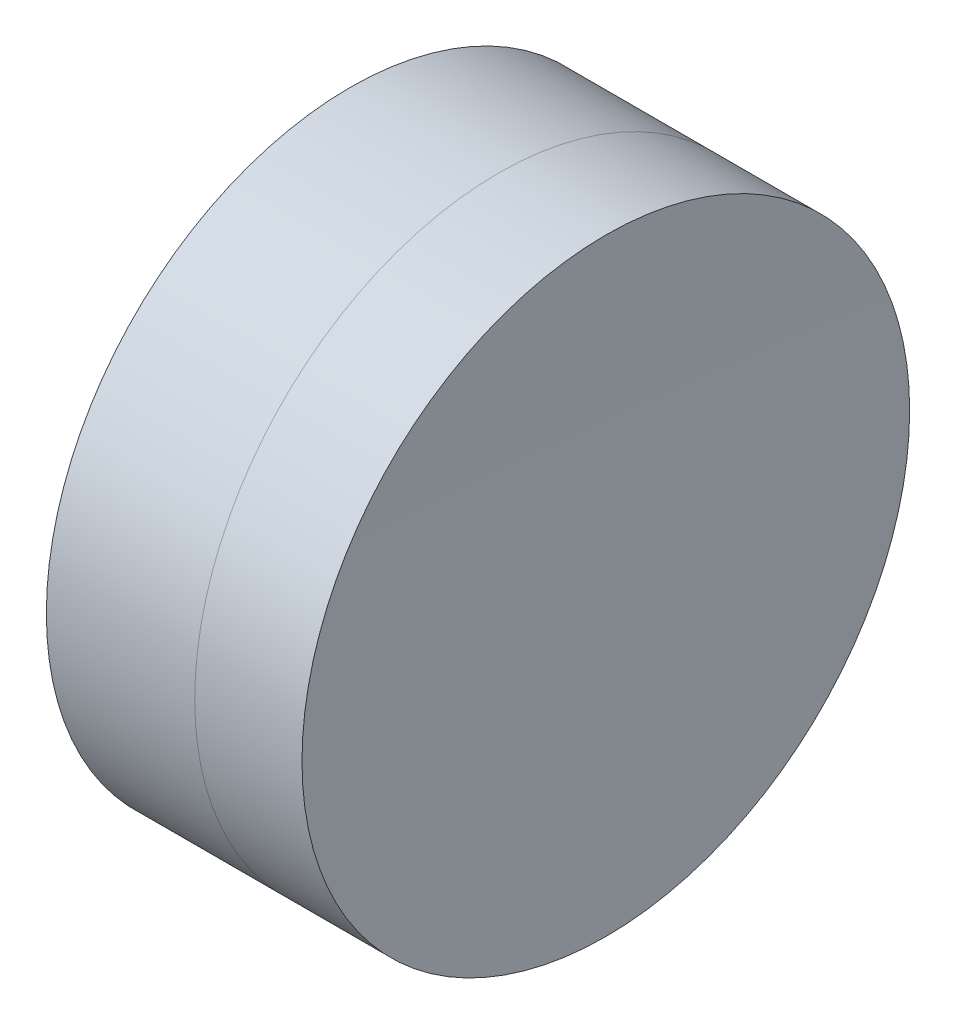
ISO-10303-21;
HEADER;
FILE_DESCRIPTION(('STEP AP214'),'2;1');
FILE_NAME('part.step','',(''),(''),'','','');
FILE_SCHEMA(('AUTOMOTIVE_DESIGN { 1 0 10303 214 1 1 1 1 }'));
ENDSEC;
DATA;
#1=APPLICATION_CONTEXT('core data for automotive mechanical design processes');
#2=APPLICATION_PROTOCOL_DEFINITION('international standard','automotive_design',2000,#1);
#3=PRODUCT_CONTEXT('',#1,'mechanical');
#4=PRODUCT('Part','Part','',(#3));
#5=PRODUCT_RELATED_PRODUCT_CATEGORY('part','',(#4));
#6=PRODUCT_DEFINITION_FORMATION('','',#4);
#7=PRODUCT_DEFINITION_CONTEXT('part definition',#1,'design');
#8=PRODUCT_DEFINITION('design','',#6,#7);
#9=PRODUCT_DEFINITION_SHAPE('','',#8);
#10=(LENGTH_UNIT() NAMED_UNIT(*) SI_UNIT(.MILLI.,.METRE.));
#11=(NAMED_UNIT(*) PLANE_ANGLE_UNIT() SI_UNIT($,.RADIAN.));
#12=(NAMED_UNIT(*) SI_UNIT($,.STERADIAN.) SOLID_ANGLE_UNIT());
#13=UNCERTAINTY_MEASURE_WITH_UNIT(LENGTH_MEASURE(1.E-05),#10,'distance_accuracy_value','');
#14=(GEOMETRIC_REPRESENTATION_CONTEXT(3) GLOBAL_UNCERTAINTY_ASSIGNED_CONTEXT((#13)) GLOBAL_UNIT_ASSIGNED_CONTEXT((#10,
#11,#12)) REPRESENTATION_CONTEXT('',''));
#15=CARTESIAN_POINT('',(0.,0.,0.));
#16=DIRECTION('',(0.,0.,1.));
#17=DIRECTION('',(1.,0.,0.));
#18=AXIS2_PLACEMENT_3D('',#15,#16,#17);
#19=CARTESIAN_POINT('',(-41.,0.,0.));
#20=DIRECTION('',(0.,0.,1.));
#21=DIRECTION('',(1.,0.,0.));
#22=AXIS2_PLACEMENT_3D('',#19,#20,#21);
#23=SPHERICAL_SURFACE('',#22,39.);
#24=CARTESIAN_POINT('',(-41.,0.,0.));
#25=DIRECTION('',(-1.,0.,0.));
#26=DIRECTION('',(0.,0.,1.));
#27=AXIS2_PLACEMENT_3D('',#24,#25,#26);
#28=SPHERICAL_SURFACE('',#27,39.);
#29=CARTESIAN_POINT('',(-4.05747707586828,0.,0.));
#30=DIRECTION('',(-1.,0.,0.));
#31=DIRECTION('',(0.,0.,1.));
#32=AXIS2_PLACEMENT_3D('',#29,#30,#31);
#33=CIRCLE('',#32,12.5);
#34=CARTESIAN_POINT('',(-4.05747707586825,-12.5,0.));
#35=VERTEX_POINT('',#34);
#36=CARTESIAN_POINT('',(-4.05747707586831,12.5,0.));
#37=VERTEX_POINT('',#36);
#38=EDGE_CURVE('P0_E56',#35,#37,#33,.T.);
#39=ORIENTED_EDGE('',*,*,#38,.T.);
#40=CARTESIAN_POINT('',(-4.05747707586828,0.,0.));
#41=DIRECTION('',(-1.,0.,0.));
#42=DIRECTION('',(0.,0.,1.));
#43=AXIS2_PLACEMENT_3D('',#40,#41,#42);
#44=CIRCLE('',#43,12.5);
#45=EDGE_CURVE('P0_E21',#37,#35,#44,.T.);
#46=ORIENTED_EDGE('',*,*,#45,.T.);
#47=EDGE_LOOP('',(#39,#46));
#48=FACE_BOUND('',#47,.T.);
#49=ADVANCED_FACE('P0_F17',(#48),#28,.F.);
#50=CARTESIAN_POINT('',(-1.00553858530506,0.,0.));
#51=DIRECTION('',(-1.,0.,0.));
#52=DIRECTION('',(0.,-1.,0.));
#53=AXIS2_PLACEMENT_3D('',#50,#51,#52);
#54=CYLINDRICAL_SURFACE('',#53,12.5);
#55=ORIENTED_EDGE('',*,*,#38,.F.);
#56=ORIENTED_EDGE('',*,*,#45,.F.);
#57=DIRECTION('',(1.,0.,0.));
#58=VECTOR('',#57,1.);
#59=CARTESIAN_POINT('',(-1.0055385853051,12.5,0.));
#60=LINE('',#59,#58);
#61=CARTESIAN_POINT('',(2.04639990525812,12.5,0.));
#62=VERTEX_POINT('',#61);
#63=EDGE_CURVE('P0_E11',#37,#62,#60,.T.);
#64=ORIENTED_EDGE('',*,*,#63,.T.);
#65=CARTESIAN_POINT('',(2.04639990525815,0.,0.));
#66=DIRECTION('',(-1.,0.,0.));
#67=DIRECTION('',(0.,0.,1.));
#68=AXIS2_PLACEMENT_3D('',#65,#66,#67);
#69=CIRCLE('',#68,12.5);
#70=CARTESIAN_POINT('',(2.04639990525818,-12.5,0.));
#71=VERTEX_POINT('',#70);
#72=EDGE_CURVE('P0_E50',#62,#71,#69,.T.);
#73=ORIENTED_EDGE('',*,*,#72,.T.);
#74=CARTESIAN_POINT('',(2.04639990525815,0.,0.));
#75=DIRECTION('',(-1.,0.,0.));
#76=DIRECTION('',(0.,0.,1.));
#77=AXIS2_PLACEMENT_3D('',#74,#75,#76);
#78=CIRCLE('',#77,12.5);
#79=EDGE_CURVE('P0_E53',#71,#62,#78,.T.);
#80=ORIENTED_EDGE('',*,*,#79,.T.);
#81=ORIENTED_EDGE('',*,*,#63,.F.);
#82=EDGE_LOOP('',(#55,#56,#64,#73,#80,#81));
#83=FACE_BOUND('',#82,.T.);
#84=ADVANCED_FACE('P0_F52',(#83),#54,.T.);
#85=CARTESIAN_POINT('',(39.2,0.,0.));
#86=DIRECTION('',(0.,0.,1.));
#87=DIRECTION('',(-0.999982337216222,0.0059435053278603,0.));
#88=AXIS2_PLACEMENT_3D('',#85,#86,#87);
#89=SPHERICAL_SURFACE('',#88,39.2);
#90=CARTESIAN_POINT('',(39.2,0.,0.));
#91=DIRECTION('',(-1.,0.,0.));
#92=DIRECTION('',(0.,0.,1.));
#93=AXIS2_PLACEMENT_3D('',#90,#91,#92);
#94=SPHERICAL_SURFACE('',#93,39.2);
#95=ORIENTED_EDGE('',*,*,#79,.F.);
#96=ORIENTED_EDGE('',*,*,#72,.F.);
#97=EDGE_LOOP('',(#95,#96));
#98=FACE_BOUND('',#97,.T.);
#99=ADVANCED_FACE('P0_F19',(#98),#94,.F.);
#100=CLOSED_SHELL('',(#49,#84,#99));
#101=MANIFOLD_SOLID_BREP('P0_B1',#100);
#102=CARTESIAN_POINT('',(4.25296488207764,0.,0.));
#103=DIRECTION('',(-1.,0.,0.));
#104=DIRECTION('',(0.,-1.,0.));
#105=AXIS2_PLACEMENT_3D('',#102,#103,#104);
#106=CYLINDRICAL_SURFACE('',#105,12.5);
#107=CARTESIAN_POINT('',(2.04639990525809,0.,0.));
#108=DIRECTION('',(-1.,0.,0.));
#109=DIRECTION('',(0.,0.,1.));
#110=AXIS2_PLACEMENT_3D('',#107,#108,#109);
#111=CIRCLE('',#110,12.5);
#112=CARTESIAN_POINT('',(2.04639990525818,-12.5,0.));
#113=VERTEX_POINT('',#112);
#114=CARTESIAN_POINT('',(2.04639990525801,12.5,0.));
#115=VERTEX_POINT('',#114);
#116=EDGE_CURVE('P1_E48',#113,#115,#111,.T.);
#117=ORIENTED_EDGE('',*,*,#116,.F.);
#118=CARTESIAN_POINT('',(2.04639990525809,0.,0.));
#119=DIRECTION('',(-1.,0.,0.));
#120=DIRECTION('',(0.,0.,1.));
#121=AXIS2_PLACEMENT_3D('',#118,#119,#120);
#122=CIRCLE('',#121,12.5);
#123=EDGE_CURVE('P1_E50',#115,#113,#122,.T.);
#124=ORIENTED_EDGE('',*,*,#123,.F.);
#125=DIRECTION('',(1.,0.,0.));
#126=VECTOR('',#125,1.);
#127=CARTESIAN_POINT('',(4.25296488207755,12.5,0.));
#128=LINE('',#127,#126);
#129=CARTESIAN_POINT('',(6.4595298588971,12.5,0.));
#130=VERTEX_POINT('',#129);
#131=EDGE_CURVE('P1_E10',#115,#130,#128,.T.);
#132=ORIENTED_EDGE('',*,*,#131,.T.);
#133=CARTESIAN_POINT('',(6.45952985889719,0.,0.));
#134=DIRECTION('',(-1.,0.,0.));
#135=DIRECTION('',(0.,0.,1.));
#136=AXIS2_PLACEMENT_3D('',#133,#134,#135);
#137=CIRCLE('',#136,12.5);
#138=CARTESIAN_POINT('',(6.45952985889728,-12.5,0.));
#139=VERTEX_POINT('',#138);
#140=EDGE_CURVE('P1_E26',#130,#139,#137,.T.);
#141=ORIENTED_EDGE('',*,*,#140,.T.);
#142=CARTESIAN_POINT('',(6.45952985889719,0.,0.));
#143=DIRECTION('',(-1.,0.,0.));
#144=DIRECTION('',(0.,0.,1.));
#145=AXIS2_PLACEMENT_3D('',#142,#143,#144);
#146=CIRCLE('',#145,12.5);
#147=EDGE_CURVE('P1_E19',#139,#130,#146,.T.);
#148=ORIENTED_EDGE('',*,*,#147,.T.);
#149=ORIENTED_EDGE('',*,*,#131,.F.);
#150=EDGE_LOOP('',(#117,#124,#132,#141,#148,#149));
#151=FACE_BOUND('',#150,.T.);
#152=ADVANCED_FACE('P1_F16',(#151),#106,.T.);
#153=CARTESIAN_POINT('',(496.1,0.,0.));
#154=DIRECTION('',(0.,0.,1.));
#155=DIRECTION('',(-0.999999999936734,1.12486646589316E-05,0.));
#156=AXIS2_PLACEMENT_3D('',#153,#154,#155);
#157=SPHERICAL_SURFACE('',#156,489.8);
#158=CARTESIAN_POINT('',(496.1,0.,0.));
#159=DIRECTION('',(-1.,0.,0.));
#160=DIRECTION('',(0.,0.,1.));
#161=AXIS2_PLACEMENT_3D('',#158,#159,#160);
#162=SPHERICAL_SURFACE('',#161,489.8);
#163=ORIENTED_EDGE('',*,*,#147,.F.);
#164=ORIENTED_EDGE('',*,*,#140,.F.);
#165=EDGE_LOOP('',(#163,#164));
#166=FACE_BOUND('',#165,.T.);
#167=ADVANCED_FACE('P1_F84',(#166),#162,.F.);
#168=CARTESIAN_POINT('',(39.2,0.,0.));
#169=DIRECTION('',(0.,0.,1.));
#170=DIRECTION('',(-0.999982337216222,0.00594350532789405,0.));
#171=AXIS2_PLACEMENT_3D('',#168,#169,#170);
#172=SPHERICAL_SURFACE('',#171,39.2);
#173=CARTESIAN_POINT('',(39.2,0.,0.));
#174=DIRECTION('',(-1.,0.,0.));
#175=DIRECTION('',(0.,0.,1.));
#176=AXIS2_PLACEMENT_3D('',#173,#174,#175);
#177=SPHERICAL_SURFACE('',#176,39.2);
#178=ORIENTED_EDGE('',*,*,#116,.T.);
#179=ORIENTED_EDGE('',*,*,#123,.T.);
#180=EDGE_LOOP('',(#178,#179));
#181=FACE_BOUND('',#180,.T.);
#182=ADVANCED_FACE('P1_F54',(#181),#177,.T.);
#183=CLOSED_SHELL('',(#152,#167,#182));
#184=MANIFOLD_SOLID_BREP('P1_B1',#183);
#185=ADVANCED_BREP_SHAPE_REPRESENTATION('',(#18,#101,#184),#14);
#186=SHAPE_DEFINITION_REPRESENTATION(#9,#185);
ENDSEC;
END-ISO-10303-21;
